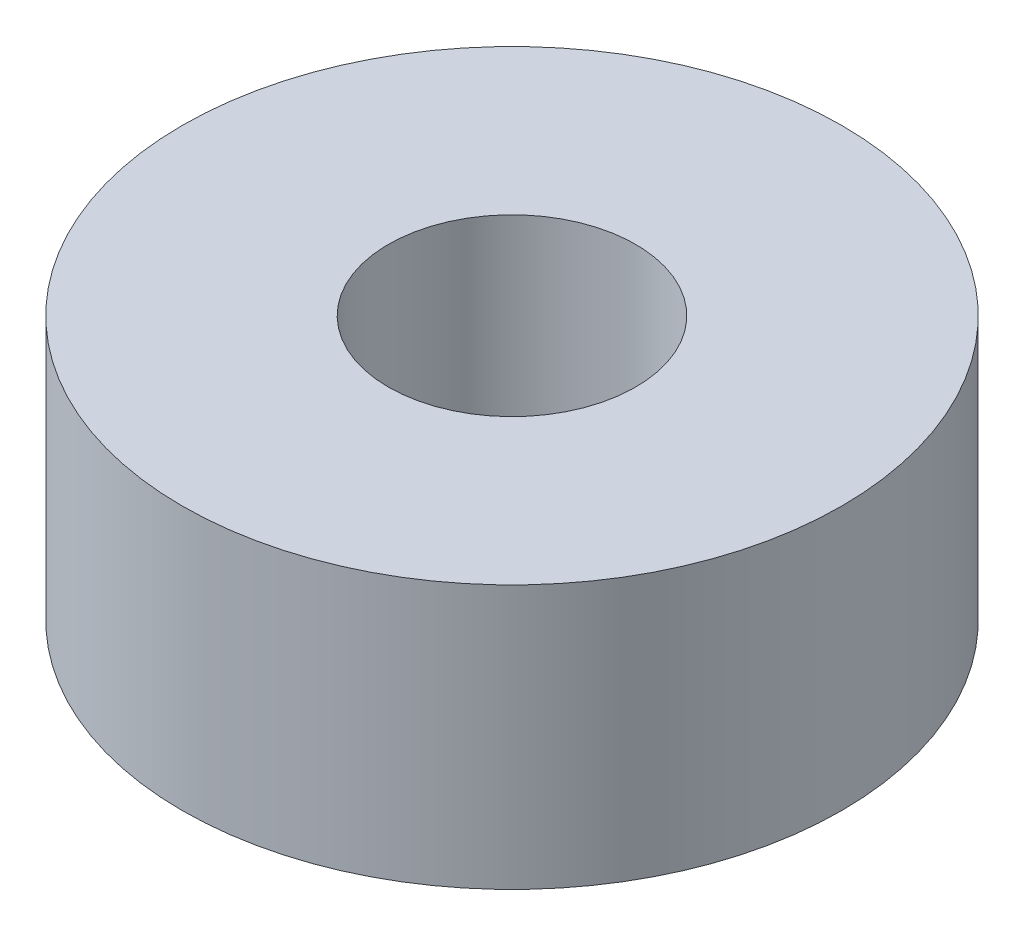
ISO-10303-21;
HEADER;
FILE_DESCRIPTION(('STEP AP214'),'2;1');
FILE_NAME('part.step','',(''),(''),'','','');
FILE_SCHEMA(('AUTOMOTIVE_DESIGN { 1 0 10303 214 1 1 1 1 }'));
ENDSEC;
DATA;
#1=APPLICATION_CONTEXT('core data for automotive mechanical design processes');
#2=APPLICATION_PROTOCOL_DEFINITION('international standard','automotive_design',2000,#1);
#3=PRODUCT_CONTEXT('',#1,'mechanical');
#4=PRODUCT('Part','Part','',(#3));
#5=PRODUCT_RELATED_PRODUCT_CATEGORY('part','',(#4));
#6=PRODUCT_DEFINITION_FORMATION('','',#4);
#7=PRODUCT_DEFINITION_CONTEXT('part definition',#1,'design');
#8=PRODUCT_DEFINITION('design','',#6,#7);
#9=PRODUCT_DEFINITION_SHAPE('','',#8);
#10=(LENGTH_UNIT() NAMED_UNIT(*) SI_UNIT(.MILLI.,.METRE.));
#11=(NAMED_UNIT(*) PLANE_ANGLE_UNIT() SI_UNIT($,.RADIAN.));
#12=(NAMED_UNIT(*) SI_UNIT($,.STERADIAN.) SOLID_ANGLE_UNIT());
#13=UNCERTAINTY_MEASURE_WITH_UNIT(LENGTH_MEASURE(1.E-05),#10,'distance_accuracy_value','');
#14=(GEOMETRIC_REPRESENTATION_CONTEXT(3) GLOBAL_UNCERTAINTY_ASSIGNED_CONTEXT((#13)) GLOBAL_UNIT_ASSIGNED_CONTEXT((#10,
#11,#12)) REPRESENTATION_CONTEXT('',''));
#15=CARTESIAN_POINT('',(0.,0.,0.));
#16=DIRECTION('',(0.,0.,1.));
#17=DIRECTION('',(1.,0.,0.));
#18=AXIS2_PLACEMENT_3D('',#15,#16,#17);
#19=CARTESIAN_POINT('',(0.,16.,0.));
#20=DIRECTION('',(0.,-1.,0.));
#21=DIRECTION('',(0.,0.,-1.));
#22=AXIS2_PLACEMENT_3D('',#19,#20,#21);
#23=CYLINDRICAL_SURFACE('',#22,20.);
#24=CARTESIAN_POINT('',(0.,16.,0.));
#25=DIRECTION('',(0.,1.,0.));
#26=DIRECTION('',(0.,0.,1.));
#27=AXIS2_PLACEMENT_3D('',#24,#25,#26);
#28=CIRCLE('',#27,20.);
#29=CARTESIAN_POINT('',(0.,16.,20.));
#30=VERTEX_POINT('',#29);
#31=EDGE_CURVE('E10',#30,#30,#28,.T.);
#32=ORIENTED_EDGE('',*,*,#31,.F.);
#33=EDGE_LOOP('',(#32));
#34=FACE_BOUND('',#33,.T.);
#35=CARTESIAN_POINT('',(0.,0.,0.));
#36=DIRECTION('',(0.,1.,0.));
#37=DIRECTION('',(0.,0.,1.));
#38=AXIS2_PLACEMENT_3D('',#35,#36,#37);
#39=CIRCLE('',#38,20.);
#40=CARTESIAN_POINT('',(0.,0.,20.));
#41=VERTEX_POINT('',#40);
#42=EDGE_CURVE('E37',#41,#41,#39,.T.);
#43=ORIENTED_EDGE('',*,*,#42,.T.);
#44=EDGE_LOOP('',(#43));
#45=FACE_BOUND('',#44,.T.);
#46=ADVANCED_FACE('F40',(#34,#45),#23,.T.);
#47=CARTESIAN_POINT('',(0.,16.,0.));
#48=DIRECTION('',(0.,1.,0.));
#49=DIRECTION('',(0.,0.,1.));
#50=AXIS2_PLACEMENT_3D('',#47,#48,#49);
#51=PLANE('',#50);
#52=CARTESIAN_POINT('',(0.,16.,0.));
#53=DIRECTION('',(0.,1.,0.));
#54=DIRECTION('',(0.,0.,1.));
#55=AXIS2_PLACEMENT_3D('',#52,#53,#54);
#56=CIRCLE('',#55,7.5);
#57=CARTESIAN_POINT('',(0.,16.,7.5));
#58=VERTEX_POINT('',#57);
#59=EDGE_CURVE('E50',#58,#58,#56,.T.);
#60=ORIENTED_EDGE('',*,*,#59,.F.);
#61=EDGE_LOOP('',(#60));
#62=FACE_BOUND('',#61,.T.);
#63=ORIENTED_EDGE('',*,*,#31,.T.);
#64=EDGE_LOOP('',(#63));
#65=FACE_BOUND('',#64,.T.);
#66=ADVANCED_FACE('F59',(#62,#65),#51,.T.);
#67=CARTESIAN_POINT('',(0.,0.,0.));
#68=DIRECTION('',(0.,1.,0.));
#69=DIRECTION('',(0.,0.,1.));
#70=AXIS2_PLACEMENT_3D('',#67,#68,#69);
#71=PLANE('',#70);
#72=CARTESIAN_POINT('',(0.,0.,0.));
#73=DIRECTION('',(0.,1.,0.));
#74=DIRECTION('',(0.,0.,1.));
#75=AXIS2_PLACEMENT_3D('',#72,#73,#74);
#76=CIRCLE('',#75,7.5);
#77=CARTESIAN_POINT('',(0.,0.,7.5));
#78=VERTEX_POINT('',#77);
#79=EDGE_CURVE('E47',#78,#78,#76,.T.);
#80=ORIENTED_EDGE('',*,*,#79,.T.);
#81=EDGE_LOOP('',(#80));
#82=FACE_BOUND('',#81,.T.);
#83=ORIENTED_EDGE('',*,*,#42,.F.);
#84=EDGE_LOOP('',(#83));
#85=FACE_BOUND('',#84,.T.);
#86=ADVANCED_FACE('F58',(#82,#85),#71,.F.);
#87=CARTESIAN_POINT('',(0.,16.,0.));
#88=DIRECTION('',(0.,-1.,0.));
#89=DIRECTION('',(0.,0.,-1.));
#90=AXIS2_PLACEMENT_3D('',#87,#88,#89);
#91=CYLINDRICAL_SURFACE('',#90,7.5);
#92=ORIENTED_EDGE('',*,*,#59,.T.);
#93=EDGE_LOOP('',(#92));
#94=FACE_BOUND('',#93,.T.);
#95=ORIENTED_EDGE('',*,*,#79,.F.);
#96=EDGE_LOOP('',(#95));
#97=FACE_BOUND('',#96,.T.);
#98=ADVANCED_FACE('F54',(#94,#97),#91,.F.);
#99=CLOSED_SHELL('',(#46,#66,#86,#98));
#100=MANIFOLD_SOLID_BREP('B2',#99);
#101=ADVANCED_BREP_SHAPE_REPRESENTATION('',(#18,#100),#14);
#102=SHAPE_DEFINITION_REPRESENTATION(#9,#101);
ENDSEC;
END-ISO-10303-21;
